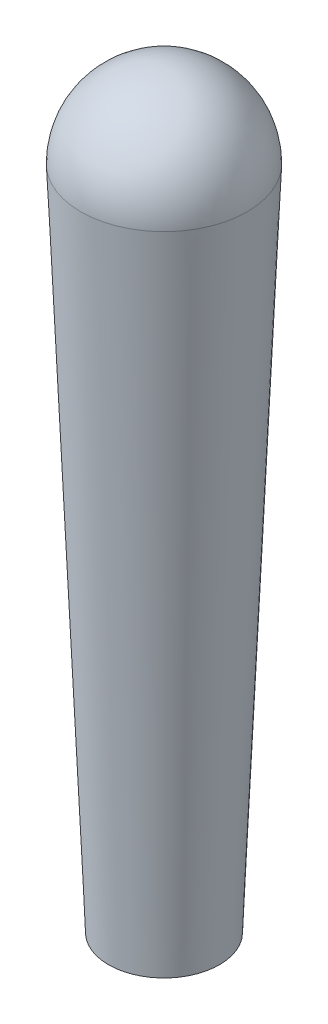
ISO-10303-21;
HEADER;
FILE_DESCRIPTION(('STEP AP214'),'2;1');
FILE_NAME('part.step','',(''),(''),'','','');
FILE_SCHEMA(('AUTOMOTIVE_DESIGN { 1 0 10303 214 1 1 1 1 }'));
ENDSEC;
DATA;
#1=APPLICATION_CONTEXT('core data for automotive mechanical design processes');
#2=APPLICATION_PROTOCOL_DEFINITION('international standard','automotive_design',2000,#1);
#3=PRODUCT_CONTEXT('',#1,'mechanical');
#4=PRODUCT('Part','Part','',(#3));
#5=PRODUCT_RELATED_PRODUCT_CATEGORY('part','',(#4));
#6=PRODUCT_DEFINITION_FORMATION('','',#4);
#7=PRODUCT_DEFINITION_CONTEXT('part definition',#1,'design');
#8=PRODUCT_DEFINITION('design','',#6,#7);
#9=PRODUCT_DEFINITION_SHAPE('','',#8);
#10=(LENGTH_UNIT() NAMED_UNIT(*) SI_UNIT(.MILLI.,.METRE.));
#11=(NAMED_UNIT(*) PLANE_ANGLE_UNIT() SI_UNIT($,.RADIAN.));
#12=(NAMED_UNIT(*) SI_UNIT($,.STERADIAN.) SOLID_ANGLE_UNIT());
#13=UNCERTAINTY_MEASURE_WITH_UNIT(LENGTH_MEASURE(1.E-05),#10,'distance_accuracy_value','');
#14=(GEOMETRIC_REPRESENTATION_CONTEXT(3) GLOBAL_UNCERTAINTY_ASSIGNED_CONTEXT((#13)) GLOBAL_UNIT_ASSIGNED_CONTEXT((#10,
#11,#12)) REPRESENTATION_CONTEXT('',''));
#15=CARTESIAN_POINT('',(0.,0.,0.));
#16=DIRECTION('',(0.,0.,1.));
#17=DIRECTION('',(1.,0.,0.));
#18=AXIS2_PLACEMENT_3D('',#15,#16,#17);
#19=CARTESIAN_POINT('',(0.,0.,0.));
#20=DIRECTION('',(0.,1.,0.));
#21=DIRECTION('',(0.,0.,1.));
#22=AXIS2_PLACEMENT_3D('',#19,#20,#21);
#23=PLANE('',#22);
#24=CARTESIAN_POINT('',(0.,0.,0.));
#25=DIRECTION('',(0.,1.,0.));
#26=DIRECTION('',(0.,0.,1.));
#27=AXIS2_PLACEMENT_3D('',#24,#25,#26);
#28=CIRCLE('',#27,1.);
#29=CARTESIAN_POINT('',(0.,0.,1.));
#30=VERTEX_POINT('',#29);
#31=EDGE_CURVE('E11',#30,#30,#28,.T.);
#32=ORIENTED_EDGE('',*,*,#31,.F.);
#33=EDGE_LOOP('',(#32));
#34=FACE_BOUND('',#33,.T.);
#35=ADVANCED_FACE('F38',(#34),#23,.F.);
#36=CARTESIAN_POINT('',(0.,0.,0.));
#37=DIRECTION('',(0.,1.,0.));
#38=DIRECTION('',(0.,0.,1.));
#39=AXIS2_PLACEMENT_3D('',#36,#37,#38);
#40=CONICAL_SURFACE('',#39,1.,0.0416425790985884);
#41=ORIENTED_EDGE('',*,*,#31,.T.);
#42=EDGE_LOOP('',(#41));
#43=FACE_BOUND('',#42,.T.);
#44=CARTESIAN_POINT('',(0.,12.,0.));
#45=DIRECTION('',(0.,1.,0.));
#46=DIRECTION('',(0.,0.,1.));
#47=AXIS2_PLACEMENT_3D('',#44,#45,#46);
#48=CIRCLE('',#47,1.5);
#49=CARTESIAN_POINT('',(0.,12.,1.5));
#50=VERTEX_POINT('',#49);
#51=EDGE_CURVE('E43',#50,#50,#48,.T.);
#52=ORIENTED_EDGE('',*,*,#51,.F.);
#53=EDGE_LOOP('',(#52));
#54=FACE_BOUND('',#53,.T.);
#55=ADVANCED_FACE('F40',(#43,#54),#40,.T.);
#56=CARTESIAN_POINT('',(0.,12.,0.));
#57=DIRECTION('',(0.,-1.,0.));
#58=DIRECTION('',(1.,0.,0.));
#59=AXIS2_PLACEMENT_3D('',#56,#57,#58);
#60=SPHERICAL_SURFACE('',#59,1.5);
#61=ORIENTED_EDGE('',*,*,#51,.T.);
#62=EDGE_LOOP('',(#61));
#63=FACE_BOUND('',#62,.T.);
#64=ADVANCED_FACE('F66',(#63),#60,.T.);
#65=CLOSED_SHELL('',(#35,#55,#64));
#66=MANIFOLD_SOLID_BREP('B2',#65);
#67=ADVANCED_BREP_SHAPE_REPRESENTATION('',(#18,#66),#14);
#68=SHAPE_DEFINITION_REPRESENTATION(#9,#67);
ENDSEC;
END-ISO-10303-21;
